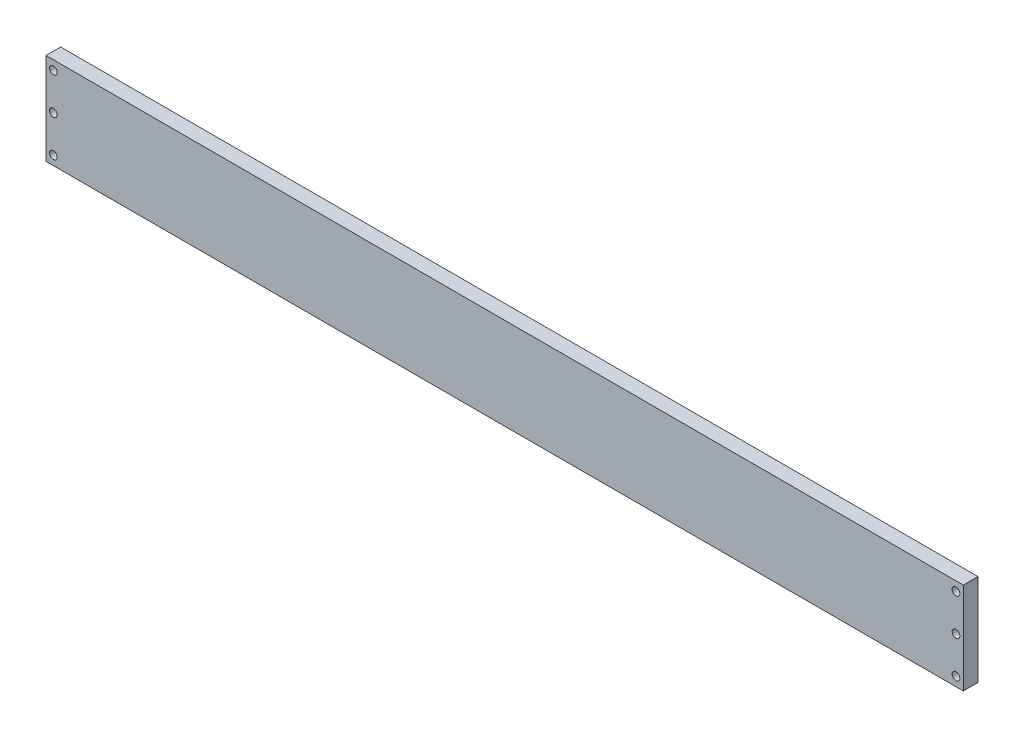
ISO-10303-21;
HEADER;
FILE_DESCRIPTION(('STEP AP214'),'2;1');
FILE_NAME('part.step','',(''),(''),'','','');
FILE_SCHEMA(('AUTOMOTIVE_DESIGN { 1 0 10303 214 1 1 1 1 }'));
ENDSEC;
DATA;
#1=APPLICATION_CONTEXT('core data for automotive mechanical design processes');
#2=APPLICATION_PROTOCOL_DEFINITION('international standard','automotive_design',2000,#1);
#3=PRODUCT_CONTEXT('',#1,'mechanical');
#4=PRODUCT('Part','Part','',(#3));
#5=PRODUCT_RELATED_PRODUCT_CATEGORY('part','',(#4));
#6=PRODUCT_DEFINITION_FORMATION('','',#4);
#7=PRODUCT_DEFINITION_CONTEXT('part definition',#1,'design');
#8=PRODUCT_DEFINITION('design','',#6,#7);
#9=PRODUCT_DEFINITION_SHAPE('','',#8);
#10=(LENGTH_UNIT() NAMED_UNIT(*) SI_UNIT(.MILLI.,.METRE.));
#11=(NAMED_UNIT(*) PLANE_ANGLE_UNIT() SI_UNIT($,.RADIAN.));
#12=(NAMED_UNIT(*) SI_UNIT($,.STERADIAN.) SOLID_ANGLE_UNIT());
#13=UNCERTAINTY_MEASURE_WITH_UNIT(LENGTH_MEASURE(1.E-05),#10,'distance_accuracy_value','');
#14=(GEOMETRIC_REPRESENTATION_CONTEXT(3) GLOBAL_UNCERTAINTY_ASSIGNED_CONTEXT((#13)) GLOBAL_UNIT_ASSIGNED_CONTEXT((#10,
#11,#12)) REPRESENTATION_CONTEXT('',''));
#15=CARTESIAN_POINT('',(0.,0.,0.));
#16=DIRECTION('',(0.,0.,1.));
#17=DIRECTION('',(1.,0.,0.));
#18=AXIS2_PLACEMENT_3D('',#15,#16,#17);
#19=CARTESIAN_POINT('',(0.,0.,8.));
#20=DIRECTION('',(0.,0.,1.));
#21=DIRECTION('',(1.,0.,0.));
#22=AXIS2_PLACEMENT_3D('',#19,#20,#21);
#23=PLANE('',#22);
#24=CARTESIAN_POINT('',(246.,0.,8.));
#25=DIRECTION('',(0.,0.,1.));
#26=DIRECTION('',(-1.,0.,0.));
#27=AXIS2_PLACEMENT_3D('',#24,#25,#26);
#28=CIRCLE('',#27,2.09999999999999);
#29=CARTESIAN_POINT('',(243.9,0.,8.));
#30=VERTEX_POINT('',#29);
#31=EDGE_CURVE('E133',#30,#30,#28,.T.);
#32=ORIENTED_EDGE('',*,*,#31,.F.);
#33=EDGE_LOOP('',(#32));
#34=FACE_BOUND('',#33,.T.);
#35=CARTESIAN_POINT('',(-246.,-20.,8.));
#36=DIRECTION('',(0.,0.,1.));
#37=DIRECTION('',(1.,0.,0.));
#38=AXIS2_PLACEMENT_3D('',#35,#36,#37);
#39=CIRCLE('',#38,2.09999999999999);
#40=CARTESIAN_POINT('',(-243.9,-20.,8.));
#41=VERTEX_POINT('',#40);
#42=EDGE_CURVE('E121',#41,#41,#39,.T.);
#43=ORIENTED_EDGE('',*,*,#42,.F.);
#44=EDGE_LOOP('',(#43));
#45=FACE_BOUND('',#44,.T.);
#46=CARTESIAN_POINT('',(-246.,0.,8.));
#47=DIRECTION('',(0.,0.,1.));
#48=DIRECTION('',(1.,0.,0.));
#49=AXIS2_PLACEMENT_3D('',#46,#47,#48);
#50=CIRCLE('',#49,2.09999999999999);
#51=CARTESIAN_POINT('',(-243.9,0.,8.));
#52=VERTEX_POINT('',#51);
#53=EDGE_CURVE('E100',#52,#52,#50,.T.);
#54=ORIENTED_EDGE('',*,*,#53,.F.);
#55=EDGE_LOOP('',(#54));
#56=FACE_BOUND('',#55,.T.);
#57=DIRECTION('',(0.,1.,0.));
#58=VECTOR('',#57,1.);
#59=CARTESIAN_POINT('',(250.,25.,8.));
#60=LINE('',#59,#58);
#61=CARTESIAN_POINT('',(250.,-25.,8.));
#62=VERTEX_POINT('',#61);
#63=CARTESIAN_POINT('',(250.,25.,8.));
#64=VERTEX_POINT('',#63);
#65=EDGE_CURVE('E85',#62,#64,#60,.T.);
#66=ORIENTED_EDGE('',*,*,#65,.T.);
#67=DIRECTION('',(-1.,0.,0.));
#68=VECTOR('',#67,1.);
#69=CARTESIAN_POINT('',(-250.,25.,8.));
#70=LINE('',#69,#68);
#71=CARTESIAN_POINT('',(-250.,25.,8.));
#72=VERTEX_POINT('',#71);
#73=EDGE_CURVE('E80',#64,#72,#70,.T.);
#74=ORIENTED_EDGE('',*,*,#73,.T.);
#75=DIRECTION('',(0.,-1.,0.));
#76=VECTOR('',#75,1.);
#77=CARTESIAN_POINT('',(-250.,25.,8.));
#78=LINE('',#77,#76);
#79=CARTESIAN_POINT('',(-250.,-25.,8.));
#80=VERTEX_POINT('',#79);
#81=EDGE_CURVE('E83',#72,#80,#78,.T.);
#82=ORIENTED_EDGE('',*,*,#81,.T.);
#83=DIRECTION('',(1.,0.,0.));
#84=VECTOR('',#83,1.);
#85=CARTESIAN_POINT('',(-250.,-25.,8.));
#86=LINE('',#85,#84);
#87=EDGE_CURVE('E50',#80,#62,#86,.T.);
#88=ORIENTED_EDGE('',*,*,#87,.T.);
#89=EDGE_LOOP('',(#66,#74,#82,#88));
#90=FACE_BOUND('',#89,.T.);
#91=CARTESIAN_POINT('',(-246.,20.,8.));
#92=DIRECTION('',(0.,0.,1.));
#93=DIRECTION('',(1.,0.,0.));
#94=AXIS2_PLACEMENT_3D('',#91,#92,#93);
#95=CIRCLE('',#94,2.09999999999999);
#96=CARTESIAN_POINT('',(-243.9,20.,8.));
#97=VERTEX_POINT('',#96);
#98=EDGE_CURVE('E115',#97,#97,#95,.T.);
#99=ORIENTED_EDGE('',*,*,#98,.F.);
#100=EDGE_LOOP('',(#99));
#101=FACE_BOUND('',#100,.T.);
#102=CARTESIAN_POINT('',(246.,20.,8.));
#103=DIRECTION('',(0.,0.,1.));
#104=DIRECTION('',(-1.,0.,0.));
#105=AXIS2_PLACEMENT_3D('',#102,#103,#104);
#106=CIRCLE('',#105,2.09999999999999);
#107=CARTESIAN_POINT('',(243.9,20.,8.));
#108=VERTEX_POINT('',#107);
#109=EDGE_CURVE('E127',#108,#108,#106,.T.);
#110=ORIENTED_EDGE('',*,*,#109,.F.);
#111=EDGE_LOOP('',(#110));
#112=FACE_BOUND('',#111,.T.);
#113=CARTESIAN_POINT('',(246.,-20.,8.));
#114=DIRECTION('',(0.,0.,1.));
#115=DIRECTION('',(-1.,0.,0.));
#116=AXIS2_PLACEMENT_3D('',#113,#114,#115);
#117=CIRCLE('',#116,2.09999999999999);
#118=CARTESIAN_POINT('',(243.9,-20.,8.));
#119=VERTEX_POINT('',#118);
#120=EDGE_CURVE('E139',#119,#119,#117,.T.);
#121=ORIENTED_EDGE('',*,*,#120,.F.);
#122=EDGE_LOOP('',(#121));
#123=FACE_BOUND('',#122,.T.);
#124=ADVANCED_FACE('F33',(#34,#45,#56,#90,#101,#112,#123),#23,.T.);
#125=CARTESIAN_POINT('',(0.,0.,0.));
#126=DIRECTION('',(0.,0.,1.));
#127=DIRECTION('',(1.,0.,0.));
#128=AXIS2_PLACEMENT_3D('',#125,#126,#127);
#129=PLANE('',#128);
#130=CARTESIAN_POINT('',(246.,0.,0.));
#131=DIRECTION('',(0.,0.,1.));
#132=DIRECTION('',(-1.,0.,0.));
#133=AXIS2_PLACEMENT_3D('',#130,#131,#132);
#134=CIRCLE('',#133,2.09999999999999);
#135=CARTESIAN_POINT('',(243.9,0.,0.));
#136=VERTEX_POINT('',#135);
#137=EDGE_CURVE('E136',#136,#136,#134,.T.);
#138=ORIENTED_EDGE('',*,*,#137,.T.);
#139=EDGE_LOOP('',(#138));
#140=FACE_BOUND('',#139,.T.);
#141=CARTESIAN_POINT('',(-246.,-20.,0.));
#142=DIRECTION('',(0.,0.,1.));
#143=DIRECTION('',(1.,0.,0.));
#144=AXIS2_PLACEMENT_3D('',#141,#142,#143);
#145=CIRCLE('',#144,2.09999999999999);
#146=CARTESIAN_POINT('',(-243.9,-20.,0.));
#147=VERTEX_POINT('',#146);
#148=EDGE_CURVE('E124',#147,#147,#145,.T.);
#149=ORIENTED_EDGE('',*,*,#148,.T.);
#150=EDGE_LOOP('',(#149));
#151=FACE_BOUND('',#150,.T.);
#152=CARTESIAN_POINT('',(-246.,0.,0.));
#153=DIRECTION('',(0.,0.,1.));
#154=DIRECTION('',(1.,0.,0.));
#155=AXIS2_PLACEMENT_3D('',#152,#153,#154);
#156=CIRCLE('',#155,2.09999999999999);
#157=CARTESIAN_POINT('',(-243.9,0.,0.));
#158=VERTEX_POINT('',#157);
#159=EDGE_CURVE('E112',#158,#158,#156,.T.);
#160=ORIENTED_EDGE('',*,*,#159,.T.);
#161=EDGE_LOOP('',(#160));
#162=FACE_BOUND('',#161,.T.);
#163=DIRECTION('',(0.,1.,0.));
#164=VECTOR('',#163,1.);
#165=CARTESIAN_POINT('',(250.,25.,0.));
#166=LINE('',#165,#164);
#167=CARTESIAN_POINT('',(250.,-25.,0.));
#168=VERTEX_POINT('',#167);
#169=CARTESIAN_POINT('',(250.,25.,0.));
#170=VERTEX_POINT('',#169);
#171=EDGE_CURVE('E97',#168,#170,#166,.T.);
#172=ORIENTED_EDGE('',*,*,#171,.F.);
#173=DIRECTION('',(1.,0.,0.));
#174=VECTOR('',#173,1.);
#175=CARTESIAN_POINT('',(-250.,-25.,0.));
#176=LINE('',#175,#174);
#177=CARTESIAN_POINT('',(-250.,-25.,0.));
#178=VERTEX_POINT('',#177);
#179=EDGE_CURVE('E73',#178,#168,#176,.T.);
#180=ORIENTED_EDGE('',*,*,#179,.F.);
#181=DIRECTION('',(0.,-1.,0.));
#182=VECTOR('',#181,1.);
#183=CARTESIAN_POINT('',(-250.,25.,0.));
#184=LINE('',#183,#182);
#185=CARTESIAN_POINT('',(-250.,25.,0.));
#186=VERTEX_POINT('',#185);
#187=EDGE_CURVE('E67',#186,#178,#184,.T.);
#188=ORIENTED_EDGE('',*,*,#187,.F.);
#189=DIRECTION('',(-1.,0.,0.));
#190=VECTOR('',#189,1.);
#191=CARTESIAN_POINT('',(-250.,25.,0.));
#192=LINE('',#191,#190);
#193=EDGE_CURVE('E89',#170,#186,#192,.T.);
#194=ORIENTED_EDGE('',*,*,#193,.F.);
#195=EDGE_LOOP('',(#172,#180,#188,#194));
#196=FACE_BOUND('',#195,.T.);
#197=CARTESIAN_POINT('',(-246.,20.,0.));
#198=DIRECTION('',(0.,0.,1.));
#199=DIRECTION('',(1.,0.,0.));
#200=AXIS2_PLACEMENT_3D('',#197,#198,#199);
#201=CIRCLE('',#200,2.09999999999999);
#202=CARTESIAN_POINT('',(-243.9,20.,0.));
#203=VERTEX_POINT('',#202);
#204=EDGE_CURVE('E118',#203,#203,#201,.T.);
#205=ORIENTED_EDGE('',*,*,#204,.T.);
#206=EDGE_LOOP('',(#205));
#207=FACE_BOUND('',#206,.T.);
#208=CARTESIAN_POINT('',(246.,20.,0.));
#209=DIRECTION('',(0.,0.,1.));
#210=DIRECTION('',(-1.,0.,0.));
#211=AXIS2_PLACEMENT_3D('',#208,#209,#210);
#212=CIRCLE('',#211,2.09999999999999);
#213=CARTESIAN_POINT('',(243.9,20.,0.));
#214=VERTEX_POINT('',#213);
#215=EDGE_CURVE('E130',#214,#214,#212,.T.);
#216=ORIENTED_EDGE('',*,*,#215,.T.);
#217=EDGE_LOOP('',(#216));
#218=FACE_BOUND('',#217,.T.);
#219=CARTESIAN_POINT('',(246.,-20.,0.));
#220=DIRECTION('',(0.,0.,1.));
#221=DIRECTION('',(-1.,0.,0.));
#222=AXIS2_PLACEMENT_3D('',#219,#220,#221);
#223=CIRCLE('',#222,2.09999999999999);
#224=CARTESIAN_POINT('',(243.9,-20.,0.));
#225=VERTEX_POINT('',#224);
#226=EDGE_CURVE('E142',#225,#225,#223,.T.);
#227=ORIENTED_EDGE('',*,*,#226,.T.);
#228=EDGE_LOOP('',(#227));
#229=FACE_BOUND('',#228,.T.);
#230=ADVANCED_FACE('F108',(#140,#151,#162,#196,#207,#218,#229),#129,.F.);
#231=CARTESIAN_POINT('',(250.,25.,8.));
#232=DIRECTION('',(-1.,0.,0.));
#233=DIRECTION('',(0.,0.,1.));
#234=AXIS2_PLACEMENT_3D('',#231,#232,#233);
#235=PLANE('',#234);
#236=ORIENTED_EDGE('',*,*,#171,.T.);
#237=DIRECTION('',(0.,0.,-1.));
#238=VECTOR('',#237,1.);
#239=CARTESIAN_POINT('',(250.,25.,8.));
#240=LINE('',#239,#238);
#241=EDGE_CURVE('E11',#64,#170,#240,.T.);
#242=ORIENTED_EDGE('',*,*,#241,.F.);
#243=ORIENTED_EDGE('',*,*,#65,.F.);
#244=DIRECTION('',(0.,0.,-1.));
#245=VECTOR('',#244,1.);
#246=CARTESIAN_POINT('',(250.,-25.,8.));
#247=LINE('',#246,#245);
#248=EDGE_CURVE('E93',#62,#168,#247,.T.);
#249=ORIENTED_EDGE('',*,*,#248,.T.);
#250=EDGE_LOOP('',(#236,#242,#243,#249));
#251=FACE_BOUND('',#250,.T.);
#252=ADVANCED_FACE('F35',(#251),#235,.F.);
#253=CARTESIAN_POINT('',(-250.,25.,8.));
#254=DIRECTION('',(0.,-1.,0.));
#255=DIRECTION('',(0.,0.,-1.));
#256=AXIS2_PLACEMENT_3D('',#253,#254,#255);
#257=PLANE('',#256);
#258=ORIENTED_EDGE('',*,*,#193,.T.);
#259=DIRECTION('',(0.,0.,-1.));
#260=VECTOR('',#259,1.);
#261=CARTESIAN_POINT('',(-250.,25.,8.));
#262=LINE('',#261,#260);
#263=EDGE_CURVE('E42',#72,#186,#262,.T.);
#264=ORIENTED_EDGE('',*,*,#263,.F.);
#265=ORIENTED_EDGE('',*,*,#73,.F.);
#266=ORIENTED_EDGE('',*,*,#241,.T.);
#267=EDGE_LOOP('',(#258,#264,#265,#266));
#268=FACE_BOUND('',#267,.T.);
#269=ADVANCED_FACE('F88',(#268),#257,.F.);
#270=CARTESIAN_POINT('',(-250.,25.,8.));
#271=DIRECTION('',(1.,0.,0.));
#272=DIRECTION('',(0.,0.,-1.));
#273=AXIS2_PLACEMENT_3D('',#270,#271,#272);
#274=PLANE('',#273);
#275=ORIENTED_EDGE('',*,*,#187,.T.);
#276=DIRECTION('',(0.,0.,-1.));
#277=VECTOR('',#276,1.);
#278=CARTESIAN_POINT('',(-250.,-25.,8.));
#279=LINE('',#278,#277);
#280=EDGE_CURVE('E90',#80,#178,#279,.T.);
#281=ORIENTED_EDGE('',*,*,#280,.F.);
#282=ORIENTED_EDGE('',*,*,#81,.F.);
#283=ORIENTED_EDGE('',*,*,#263,.T.);
#284=EDGE_LOOP('',(#275,#281,#282,#283));
#285=FACE_BOUND('',#284,.T.);
#286=ADVANCED_FACE('F91',(#285),#274,.F.);
#287=CARTESIAN_POINT('',(-250.,-25.,8.));
#288=DIRECTION('',(0.,1.,0.));
#289=DIRECTION('',(0.,0.,1.));
#290=AXIS2_PLACEMENT_3D('',#287,#288,#289);
#291=PLANE('',#290);
#292=ORIENTED_EDGE('',*,*,#179,.T.);
#293=ORIENTED_EDGE('',*,*,#248,.F.);
#294=ORIENTED_EDGE('',*,*,#87,.F.);
#295=ORIENTED_EDGE('',*,*,#280,.T.);
#296=EDGE_LOOP('',(#292,#293,#294,#295));
#297=FACE_BOUND('',#296,.T.);
#298=ADVANCED_FACE('F105',(#297),#291,.F.);
#299=CARTESIAN_POINT('',(-246.,0.,8.));
#300=DIRECTION('',(0.,0.,-1.));
#301=DIRECTION('',(-1.,0.,0.));
#302=AXIS2_PLACEMENT_3D('',#299,#300,#301);
#303=CYLINDRICAL_SURFACE('',#302,2.09999999999999);
#304=ORIENTED_EDGE('',*,*,#53,.T.);
#305=EDGE_LOOP('',(#304));
#306=FACE_BOUND('',#305,.T.);
#307=ORIENTED_EDGE('',*,*,#159,.F.);
#308=EDGE_LOOP('',(#307));
#309=FACE_BOUND('',#308,.T.);
#310=ADVANCED_FACE('F162',(#306,#309),#303,.F.);
#311=CARTESIAN_POINT('',(-246.,20.,8.));
#312=DIRECTION('',(0.,0.,-1.));
#313=DIRECTION('',(-1.,0.,0.));
#314=AXIS2_PLACEMENT_3D('',#311,#312,#313);
#315=CYLINDRICAL_SURFACE('',#314,2.09999999999999);
#316=ORIENTED_EDGE('',*,*,#98,.T.);
#317=EDGE_LOOP('',(#316));
#318=FACE_BOUND('',#317,.T.);
#319=ORIENTED_EDGE('',*,*,#204,.F.);
#320=EDGE_LOOP('',(#319));
#321=FACE_BOUND('',#320,.T.);
#322=ADVANCED_FACE('F208',(#318,#321),#315,.F.);
#323=CARTESIAN_POINT('',(-246.,-20.,8.));
#324=DIRECTION('',(0.,0.,-1.));
#325=DIRECTION('',(-1.,0.,0.));
#326=AXIS2_PLACEMENT_3D('',#323,#324,#325);
#327=CYLINDRICAL_SURFACE('',#326,2.09999999999999);
#328=ORIENTED_EDGE('',*,*,#42,.T.);
#329=EDGE_LOOP('',(#328));
#330=FACE_BOUND('',#329,.T.);
#331=ORIENTED_EDGE('',*,*,#148,.F.);
#332=EDGE_LOOP('',(#331));
#333=FACE_BOUND('',#332,.T.);
#334=ADVANCED_FACE('F216',(#330,#333),#327,.F.);
#335=CARTESIAN_POINT('',(246.,20.,8.));
#336=DIRECTION('',(0.,0.,-1.));
#337=DIRECTION('',(-1.,0.,0.));
#338=AXIS2_PLACEMENT_3D('',#335,#336,#337);
#339=CYLINDRICAL_SURFACE('',#338,2.09999999999999);
#340=ORIENTED_EDGE('',*,*,#109,.T.);
#341=EDGE_LOOP('',(#340));
#342=FACE_BOUND('',#341,.T.);
#343=ORIENTED_EDGE('',*,*,#215,.F.);
#344=EDGE_LOOP('',(#343));
#345=FACE_BOUND('',#344,.T.);
#346=ADVANCED_FACE('F224',(#342,#345),#339,.F.);
#347=CARTESIAN_POINT('',(246.,0.,8.));
#348=DIRECTION('',(0.,0.,-1.));
#349=DIRECTION('',(-1.,0.,0.));
#350=AXIS2_PLACEMENT_3D('',#347,#348,#349);
#351=CYLINDRICAL_SURFACE('',#350,2.09999999999999);
#352=ORIENTED_EDGE('',*,*,#31,.T.);
#353=EDGE_LOOP('',(#352));
#354=FACE_BOUND('',#353,.T.);
#355=ORIENTED_EDGE('',*,*,#137,.F.);
#356=EDGE_LOOP('',(#355));
#357=FACE_BOUND('',#356,.T.);
#358=ADVANCED_FACE('F233',(#354,#357),#351,.F.);
#359=CARTESIAN_POINT('',(246.,-20.,8.));
#360=DIRECTION('',(0.,0.,-1.));
#361=DIRECTION('',(-1.,0.,0.));
#362=AXIS2_PLACEMENT_3D('',#359,#360,#361);
#363=CYLINDRICAL_SURFACE('',#362,2.09999999999999);
#364=ORIENTED_EDGE('',*,*,#120,.T.);
#365=EDGE_LOOP('',(#364));
#366=FACE_BOUND('',#365,.T.);
#367=ORIENTED_EDGE('',*,*,#226,.F.);
#368=EDGE_LOOP('',(#367));
#369=FACE_BOUND('',#368,.T.);
#370=ADVANCED_FACE('F148',(#366,#369),#363,.F.);
#371=CLOSED_SHELL('',(#124,#230,#252,#269,#286,#298,#310,#322,#334,#346,#358,#370));
#372=MANIFOLD_SOLID_BREP('B2',#371);
#373=ADVANCED_BREP_SHAPE_REPRESENTATION('',(#18,#372),#14);
#374=SHAPE_DEFINITION_REPRESENTATION(#9,#373);
ENDSEC;
END-ISO-10303-21;
